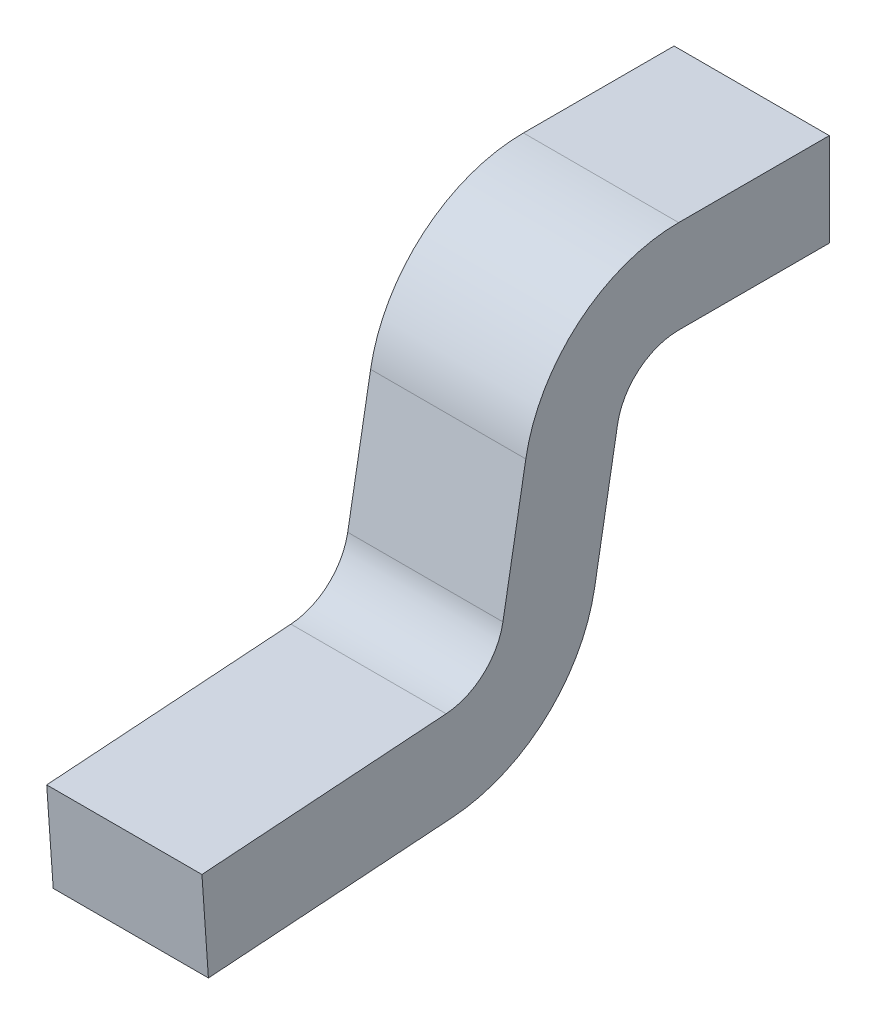
ISO-10303-21;
HEADER;
FILE_DESCRIPTION(('STEP AP214'),'2;1');
FILE_NAME('part.step','',(''),(''),'','','');
FILE_SCHEMA(('AUTOMOTIVE_DESIGN { 1 0 10303 214 1 1 1 1 }'));
ENDSEC;
DATA;
#1=APPLICATION_CONTEXT('core data for automotive mechanical design processes');
#2=APPLICATION_PROTOCOL_DEFINITION('international standard','automotive_design',2000,#1);
#3=PRODUCT_CONTEXT('',#1,'mechanical');
#4=PRODUCT('Part','Part','',(#3));
#5=PRODUCT_RELATED_PRODUCT_CATEGORY('part','',(#4));
#6=PRODUCT_DEFINITION_FORMATION('','',#4);
#7=PRODUCT_DEFINITION_CONTEXT('part definition',#1,'design');
#8=PRODUCT_DEFINITION('design','',#6,#7);
#9=PRODUCT_DEFINITION_SHAPE('','',#8);
#10=(LENGTH_UNIT() NAMED_UNIT(*) SI_UNIT(.MILLI.,.METRE.));
#11=(NAMED_UNIT(*) PLANE_ANGLE_UNIT() SI_UNIT($,.RADIAN.));
#12=(NAMED_UNIT(*) SI_UNIT($,.STERADIAN.) SOLID_ANGLE_UNIT());
#13=UNCERTAINTY_MEASURE_WITH_UNIT(LENGTH_MEASURE(1.E-05),#10,'distance_accuracy_value','');
#14=(GEOMETRIC_REPRESENTATION_CONTEXT(3) GLOBAL_UNCERTAINTY_ASSIGNED_CONTEXT((#13)) GLOBAL_UNIT_ASSIGNED_CONTEXT((#10,
#11,#12)) REPRESENTATION_CONTEXT('',''));
#15=CARTESIAN_POINT('',(0.,0.,0.));
#16=DIRECTION('',(0.,0.,1.));
#17=DIRECTION('',(1.,0.,0.));
#18=AXIS2_PLACEMENT_3D('',#15,#16,#17);
#19=CARTESIAN_POINT('',(-0.125,0.,0.));
#20=DIRECTION('',(1.,0.,0.));
#21=DIRECTION('',(0.,0.,-1.));
#22=AXIS2_PLACEMENT_3D('',#19,#20,#21);
#23=PLANE('',#22);
#24=DIRECTION('',(0.,0.,1.));
#25=VECTOR('',#24,1.);
#26=CARTESIAN_POINT('',(-0.125,0.425,-0.375));
#27=LINE('',#26,#25);
#28=CARTESIAN_POINT('',(-0.125,0.425,-0.375));
#29=VERTEX_POINT('',#28);
#30=CARTESIAN_POINT('',(-0.125,0.425,-0.1323998828126));
#31=VERTEX_POINT('',#30);
#32=EDGE_CURVE('E11',#29,#31,#27,.T.);
#33=ORIENTED_EDGE('',*,*,#32,.F.);
#34=DIRECTION('',(0.,1.,0.));
#35=VECTOR('',#34,1.);
#36=CARTESIAN_POINT('',(-0.125,0.275,-0.375));
#37=LINE('',#36,#35);
#38=CARTESIAN_POINT('',(-0.125,0.275,-0.375));
#39=VERTEX_POINT('',#38);
#40=EDGE_CURVE('E202',#39,#29,#37,.T.);
#41=ORIENTED_EDGE('',*,*,#40,.F.);
#42=DIRECTION('',(0.,0.,-1.));
#43=VECTOR('',#42,1.);
#44=CARTESIAN_POINT('',(-0.125,0.275,-0.1323998828126));
#45=LINE('',#44,#43);
#46=CARTESIAN_POINT('',(-0.125,0.275,-0.1323998828126));
#47=VERTEX_POINT('',#46);
#48=EDGE_CURVE('E194',#47,#39,#45,.T.);
#49=ORIENTED_EDGE('',*,*,#48,.F.);
#50=CARTESIAN_POINT('',(-0.125,0.175,-0.1323998828126));
#51=DIRECTION('',(1.,0.,0.));
#52=DIRECTION('',(0.,1.,0.));
#53=AXIS2_PLACEMENT_3D('',#50,#51,#52);
#54=CIRCLE('',#53,0.1);
#55=CARTESIAN_POINT('',(-0.125,0.1923648177667,-0.03391910751134));
#56=VERTEX_POINT('',#55);
#57=EDGE_CURVE('E187',#47,#56,#54,.T.);
#58=ORIENTED_EDGE('',*,*,#57,.T.);
#59=DIRECTION('',(0.,-0.984807753012213,0.173648177666902));
#60=VECTOR('',#59,1.);
#61=CARTESIAN_POINT('',(-0.125,0.1923648177667,-0.03391910751134));
#62=LINE('',#61,#60);
#63=CARTESIAN_POINT('',(-0.125,-0.01651708444881,0.002912407630965));
#64=VERTEX_POINT('',#63);
#65=EDGE_CURVE('E180',#56,#64,#62,.T.);
#66=ORIENTED_EDGE('',*,*,#65,.T.);
#67=CARTESIAN_POINT('',(-0.125,0.02689495996792,0.249114345884));
#68=DIRECTION('',(-1.,0.,0.));
#69=DIRECTION('',(0.,-0.173648177666902,-0.984807753012213));
#70=AXIS2_PLACEMENT_3D('',#67,#68,#69);
#71=CIRCLE('',#70,0.25);
#72=CARTESIAN_POINT('',(-0.125,-0.222496052597,0.231675227448));
#73=VERTEX_POINT('',#72);
#74=EDGE_CURVE('E175',#64,#73,#71,.T.);
#75=ORIENTED_EDGE('',*,*,#74,.T.);
#76=DIRECTION('',(0.,0.0697564737441317,-0.997564050259824));
#77=VECTOR('',#76,1.);
#78=CARTESIAN_POINT('',(-0.125,-0.25,0.625));
#79=LINE('',#78,#77);
#80=CARTESIAN_POINT('',(-0.125,-0.25,0.625));
#81=VERTEX_POINT('',#80);
#82=EDGE_CURVE('E163',#81,#73,#79,.T.);
#83=ORIENTED_EDGE('',*,*,#82,.F.);
#84=DIRECTION('',(0.,-0.997564050259824,-0.0697564737441316));
#85=VECTOR('',#84,1.);
#86=CARTESIAN_POINT('',(-0.125,-0.100365392461,0.6354634710616));
#87=LINE('',#86,#85);
#88=CARTESIAN_POINT('',(-0.125,-0.100365392461,0.6354634710616));
#89=VERTEX_POINT('',#88);
#90=EDGE_CURVE('E152',#89,#81,#87,.T.);
#91=ORIENTED_EDGE('',*,*,#90,.F.);
#92=DIRECTION('',(0.,-0.0697564737441317,0.997564050259824));
#93=VECTOR('',#92,1.);
#94=CARTESIAN_POINT('',(-0.125,-0.07286144505806,0.2421386985096));
#95=LINE('',#94,#93);
#96=CARTESIAN_POINT('',(-0.125,-0.07286144505806,0.2421386985096));
#97=VERTEX_POINT('',#96);
#98=EDGE_CURVE('E144',#97,#89,#95,.T.);
#99=ORIENTED_EDGE('',*,*,#98,.F.);
#100=CARTESIAN_POINT('',(-0.125,0.02689495996792,0.249114345884));
#101=DIRECTION('',(1.,0.,0.));
#102=DIRECTION('',(0.,-0.997564050259824,-0.0697564737441317));
#103=AXIS2_PLACEMENT_3D('',#100,#101,#102);
#104=CIRCLE('',#103,0.1);
#105=CARTESIAN_POINT('',(-0.125,0.009530142201232,0.1506335705828));
#106=VERTEX_POINT('',#105);
#107=EDGE_CURVE('E128',#97,#106,#104,.T.);
#108=ORIENTED_EDGE('',*,*,#107,.T.);
#109=DIRECTION('',(0.,0.984807753012213,-0.173648177666902));
#110=VECTOR('',#109,1.);
#111=CARTESIAN_POINT('',(-0.125,0.009530142201232,0.1506335705828));
#112=LINE('',#111,#110);
#113=CARTESIAN_POINT('',(-0.125,0.2184120444167,0.1138020554405));
#114=VERTEX_POINT('',#113);
#115=EDGE_CURVE('E125',#106,#114,#112,.T.);
#116=ORIENTED_EDGE('',*,*,#115,.T.);
#117=CARTESIAN_POINT('',(-0.125,0.175,-0.1323998828126));
#118=DIRECTION('',(-1.,0.,0.));
#119=DIRECTION('',(0.,0.173648177666902,0.984807753012213));
#120=AXIS2_PLACEMENT_3D('',#117,#118,#119);
#121=CIRCLE('',#120,0.25);
#122=EDGE_CURVE('E182',#114,#31,#121,.T.);
#123=ORIENTED_EDGE('',*,*,#122,.T.);
#124=EDGE_LOOP('',(#33,#41,#49,#58,#66,#75,#83,#91,#99,#108,#116,#123));
#125=FACE_BOUND('',#124,.T.);
#126=ADVANCED_FACE('F17',(#125),#23,.F.);
#127=CARTESIAN_POINT('',(0.4509,0.175,-0.1323998828126));
#128=DIRECTION('',(-1.,0.,0.));
#129=DIRECTION('',(0.,0.173648177666902,0.984807753012213));
#130=AXIS2_PLACEMENT_3D('',#127,#128,#129);
#131=CYLINDRICAL_SURFACE('',#130,0.25);
#132=DIRECTION('',(-1.,0.,0.));
#133=VECTOR('',#132,1.);
#134=CARTESIAN_POINT('',(0.125,0.2184120444167,0.1138020554405));
#135=LINE('',#134,#133);
#136=CARTESIAN_POINT('',(0.125,0.2184120444167,0.1138020554405));
#137=VERTEX_POINT('',#136);
#138=EDGE_CURVE('E24',#137,#114,#135,.T.);
#139=ORIENTED_EDGE('',*,*,#138,.F.);
#140=CARTESIAN_POINT('',(0.125,0.175,-0.1323998828126));
#141=DIRECTION('',(1.,0.,0.));
#142=DIRECTION('',(0.,1.,0.));
#143=AXIS2_PLACEMENT_3D('',#140,#141,#142);
#144=CIRCLE('',#143,0.25);
#145=CARTESIAN_POINT('',(0.125,0.425,-0.1323998828126));
#146=VERTEX_POINT('',#145);
#147=EDGE_CURVE('E197',#146,#137,#144,.T.);
#148=ORIENTED_EDGE('',*,*,#147,.F.);
#149=DIRECTION('',(-1.,0.,0.));
#150=VECTOR('',#149,1.);
#151=CARTESIAN_POINT('',(0.125,0.425,-0.1323998828126));
#152=LINE('',#151,#150);
#153=EDGE_CURVE('E189',#146,#31,#152,.T.);
#154=ORIENTED_EDGE('',*,*,#153,.T.);
#155=ORIENTED_EDGE('',*,*,#122,.F.);
#156=EDGE_LOOP('',(#139,#148,#154,#155));
#157=FACE_BOUND('',#156,.T.);
#158=ADVANCED_FACE('F208',(#157),#131,.T.);
#159=CARTESIAN_POINT('',(-0.125,0.425,-0.375));
#160=DIRECTION('',(0.,1.,0.));
#161=DIRECTION('',(0.,0.,1.));
#162=AXIS2_PLACEMENT_3D('',#159,#160,#161);
#163=PLANE('',#162);
#164=DIRECTION('',(0.,0.,1.));
#165=VECTOR('',#164,1.);
#166=CARTESIAN_POINT('',(0.125,0.425,-0.375));
#167=LINE('',#166,#165);
#168=CARTESIAN_POINT('',(0.125,0.425,-0.375));
#169=VERTEX_POINT('',#168);
#170=EDGE_CURVE('E199',#169,#146,#167,.T.);
#171=ORIENTED_EDGE('',*,*,#170,.F.);
#172=DIRECTION('',(1.,0.,0.));
#173=VECTOR('',#172,1.);
#174=CARTESIAN_POINT('',(-0.125,0.425,-0.375));
#175=LINE('',#174,#173);
#176=EDGE_CURVE('E191',#29,#169,#175,.T.);
#177=ORIENTED_EDGE('',*,*,#176,.F.);
#178=ORIENTED_EDGE('',*,*,#32,.T.);
#179=ORIENTED_EDGE('',*,*,#153,.F.);
#180=EDGE_LOOP('',(#171,#177,#178,#179));
#181=FACE_BOUND('',#180,.T.);
#182=ADVANCED_FACE('F210',(#181),#163,.T.);
#183=CARTESIAN_POINT('',(-0.125,0.275,-0.375));
#184=DIRECTION('',(0.,0.,-1.));
#185=DIRECTION('',(0.,1.,0.));
#186=AXIS2_PLACEMENT_3D('',#183,#184,#185);
#187=PLANE('',#186);
#188=ORIENTED_EDGE('',*,*,#176,.T.);
#189=DIRECTION('',(0.,1.,0.));
#190=VECTOR('',#189,1.);
#191=CARTESIAN_POINT('',(0.125,0.275,-0.375));
#192=LINE('',#191,#190);
#193=CARTESIAN_POINT('',(0.125,0.275,-0.375));
#194=VERTEX_POINT('',#193);
#195=EDGE_CURVE('E184',#194,#169,#192,.T.);
#196=ORIENTED_EDGE('',*,*,#195,.F.);
#197=DIRECTION('',(1.,0.,0.));
#198=VECTOR('',#197,1.);
#199=CARTESIAN_POINT('',(-0.125,0.275,-0.375));
#200=LINE('',#199,#198);
#201=EDGE_CURVE('E177',#39,#194,#200,.T.);
#202=ORIENTED_EDGE('',*,*,#201,.F.);
#203=ORIENTED_EDGE('',*,*,#40,.T.);
#204=EDGE_LOOP('',(#188,#196,#202,#203));
#205=FACE_BOUND('',#204,.T.);
#206=ADVANCED_FACE('F235',(#205),#187,.T.);
#207=CARTESIAN_POINT('',(-0.125,0.275,-0.04848991969483));
#208=DIRECTION('',(0.,-1.,0.));
#209=DIRECTION('',(0.,0.,-1.));
#210=AXIS2_PLACEMENT_3D('',#207,#208,#209);
#211=PLANE('',#210);
#212=ORIENTED_EDGE('',*,*,#48,.T.);
#213=ORIENTED_EDGE('',*,*,#201,.T.);
#214=DIRECTION('',(0.,0.,-1.));
#215=VECTOR('',#214,1.);
#216=CARTESIAN_POINT('',(0.125,0.275,-0.1323998828126));
#217=LINE('',#216,#215);
#218=CARTESIAN_POINT('',(0.125,0.275,-0.1323998828126));
#219=VERTEX_POINT('',#218);
#220=EDGE_CURVE('E166',#219,#194,#217,.T.);
#221=ORIENTED_EDGE('',*,*,#220,.F.);
#222=DIRECTION('',(-1.,0.,0.));
#223=VECTOR('',#222,1.);
#224=CARTESIAN_POINT('',(0.125,0.275,-0.1323998828126));
#225=LINE('',#224,#223);
#226=EDGE_CURVE('E169',#219,#47,#225,.T.);
#227=ORIENTED_EDGE('',*,*,#226,.T.);
#228=EDGE_LOOP('',(#212,#213,#221,#227));
#229=FACE_BOUND('',#228,.T.);
#230=ADVANCED_FACE('F232',(#229),#211,.T.);
#231=CARTESIAN_POINT('',(0.4509,0.175,-0.1323998828126));
#232=DIRECTION('',(-1.,0.,0.));
#233=DIRECTION('',(0.,0.173648177666902,0.984807753012213));
#234=AXIS2_PLACEMENT_3D('',#231,#232,#233);
#235=CYLINDRICAL_SURFACE('',#234,0.1);
#236=ORIENTED_EDGE('',*,*,#57,.F.);
#237=ORIENTED_EDGE('',*,*,#226,.F.);
#238=CARTESIAN_POINT('',(0.125,0.175,-0.1323998828126));
#239=DIRECTION('',(-1.,0.,0.));
#240=DIRECTION('',(0.,0.173648177666902,0.984807753012213));
#241=AXIS2_PLACEMENT_3D('',#238,#239,#240);
#242=CIRCLE('',#241,0.1);
#243=CARTESIAN_POINT('',(0.125,0.1923648177667,-0.03391910751134));
#244=VERTEX_POINT('',#243);
#245=EDGE_CURVE('E155',#244,#219,#242,.T.);
#246=ORIENTED_EDGE('',*,*,#245,.F.);
#247=DIRECTION('',(-1.,0.,0.));
#248=VECTOR('',#247,1.);
#249=CARTESIAN_POINT('',(0.125,0.1923648177667,-0.03391910751134));
#250=LINE('',#249,#248);
#251=EDGE_CURVE('E146',#244,#56,#250,.T.);
#252=ORIENTED_EDGE('',*,*,#251,.T.);
#253=EDGE_LOOP('',(#236,#237,#246,#252));
#254=FACE_BOUND('',#253,.T.);
#255=ADVANCED_FACE('F230',(#254),#235,.F.);
#256=CARTESIAN_POINT('',(-0.125,-0.208871120024,0.03682961395103));
#257=DIRECTION('',(0.,-0.173648177666902,-0.984807753012213));
#258=DIRECTION('',(0.,0.984807753012213,-0.173648177666902));
#259=AXIS2_PLACEMENT_3D('',#256,#257,#258);
#260=PLANE('',#259);
#261=DIRECTION('',(0.,0.984807753012213,-0.173648177666902));
#262=VECTOR('',#261,1.);
#263=CARTESIAN_POINT('',(0.125,-0.01651708444881,0.002912407630965));
#264=LINE('',#263,#262);
#265=CARTESIAN_POINT('',(0.125,-0.01651708444881,0.002912407630965));
#266=VERTEX_POINT('',#265);
#267=EDGE_CURVE('E172',#266,#244,#264,.T.);
#268=ORIENTED_EDGE('',*,*,#267,.F.);
#269=DIRECTION('',(1.,0.,0.));
#270=VECTOR('',#269,1.);
#271=CARTESIAN_POINT('',(-0.125,-0.01651708444881,0.002912407630965));
#272=LINE('',#271,#270);
#273=EDGE_CURVE('E158',#64,#266,#272,.T.);
#274=ORIENTED_EDGE('',*,*,#273,.F.);
#275=ORIENTED_EDGE('',*,*,#65,.F.);
#276=ORIENTED_EDGE('',*,*,#251,.F.);
#277=EDGE_LOOP('',(#268,#274,#275,#276));
#278=FACE_BOUND('',#277,.T.);
#279=ADVANCED_FACE('F225',(#278),#260,.T.);
#280=CARTESIAN_POINT('',(-0.125,0.02689495996792,0.249114345884));
#281=DIRECTION('',(-1.,0.,0.));
#282=DIRECTION('',(0.,-0.173648177666902,-0.984807753012213));
#283=AXIS2_PLACEMENT_3D('',#280,#281,#282);
#284=CYLINDRICAL_SURFACE('',#283,0.25);
#285=CARTESIAN_POINT('',(0.125,0.02689495996792,0.249114345884));
#286=DIRECTION('',(-1.,0.,0.));
#287=DIRECTION('',(0.,-0.173648177666902,-0.984807753012213));
#288=AXIS2_PLACEMENT_3D('',#285,#286,#287);
#289=CIRCLE('',#288,0.25);
#290=CARTESIAN_POINT('',(0.125,-0.222496052597,0.231675227448));
#291=VERTEX_POINT('',#290);
#292=EDGE_CURVE('E161',#266,#291,#289,.T.);
#293=ORIENTED_EDGE('',*,*,#292,.T.);
#294=DIRECTION('',(1.,0.,0.));
#295=VECTOR('',#294,1.);
#296=CARTESIAN_POINT('',(-0.125,-0.222496052597,0.231675227448));
#297=LINE('',#296,#295);
#298=EDGE_CURVE('E149',#73,#291,#297,.T.);
#299=ORIENTED_EDGE('',*,*,#298,.F.);
#300=ORIENTED_EDGE('',*,*,#74,.F.);
#301=ORIENTED_EDGE('',*,*,#273,.T.);
#302=EDGE_LOOP('',(#293,#299,#300,#301));
#303=FACE_BOUND('',#302,.T.);
#304=ADVANCED_FACE('F221',(#303),#284,.T.);
#305=CARTESIAN_POINT('',(-0.125,-0.25,0.625));
#306=DIRECTION('',(0.,-0.997564050259824,-0.0697564737441317));
#307=DIRECTION('',(0.,0.0697564737441317,-0.997564050259824));
#308=AXIS2_PLACEMENT_3D('',#305,#306,#307);
#309=PLANE('',#308);
#310=ORIENTED_EDGE('',*,*,#298,.T.);
#311=DIRECTION('',(0.,0.0697564737441317,-0.997564050259824));
#312=VECTOR('',#311,1.);
#313=CARTESIAN_POINT('',(0.125,-0.25,0.625));
#314=LINE('',#313,#312);
#315=CARTESIAN_POINT('',(0.125,-0.25,0.625));
#316=VERTEX_POINT('',#315);
#317=EDGE_CURVE('E139',#316,#291,#314,.T.);
#318=ORIENTED_EDGE('',*,*,#317,.F.);
#319=DIRECTION('',(1.,0.,0.));
#320=VECTOR('',#319,1.);
#321=CARTESIAN_POINT('',(-0.125,-0.25,0.625));
#322=LINE('',#321,#320);
#323=EDGE_CURVE('E142',#81,#316,#322,.T.);
#324=ORIENTED_EDGE('',*,*,#323,.F.);
#325=ORIENTED_EDGE('',*,*,#82,.T.);
#326=EDGE_LOOP('',(#310,#318,#324,#325));
#327=FACE_BOUND('',#326,.T.);
#328=ADVANCED_FACE('F217',(#327),#309,.T.);
#329=CARTESIAN_POINT('',(-0.125,-0.100365392461,0.6354634710616));
#330=DIRECTION('',(0.,-0.0697564737441317,0.997564050259824));
#331=DIRECTION('',(0.,-0.997564050259824,-0.0697564737441317));
#332=AXIS2_PLACEMENT_3D('',#329,#330,#331);
#333=PLANE('',#332);
#334=ORIENTED_EDGE('',*,*,#323,.T.);
#335=DIRECTION('',(0.,-0.997564050259824,-0.0697564737441316));
#336=VECTOR('',#335,1.);
#337=CARTESIAN_POINT('',(0.125,-0.100365392461,0.6354634710616));
#338=LINE('',#337,#336);
#339=CARTESIAN_POINT('',(0.125,-0.100365392461,0.6354634710616));
#340=VERTEX_POINT('',#339);
#341=EDGE_CURVE('E135',#340,#316,#338,.T.);
#342=ORIENTED_EDGE('',*,*,#341,.F.);
#343=DIRECTION('',(1.,0.,0.));
#344=VECTOR('',#343,1.);
#345=CARTESIAN_POINT('',(-0.125,-0.100365392461,0.6354634710616));
#346=LINE('',#345,#344);
#347=EDGE_CURVE('E111',#89,#340,#346,.T.);
#348=ORIENTED_EDGE('',*,*,#347,.F.);
#349=ORIENTED_EDGE('',*,*,#90,.T.);
#350=EDGE_LOOP('',(#334,#342,#348,#349));
#351=FACE_BOUND('',#350,.T.);
#352=ADVANCED_FACE('F213',(#351),#333,.T.);
#353=CARTESIAN_POINT('',(-0.125,-0.06741147202885,0.1642004531108));
#354=DIRECTION('',(0.,0.997564050259824,0.0697564737441317));
#355=DIRECTION('',(0.,-0.0697564737441317,0.997564050259824));
#356=AXIS2_PLACEMENT_3D('',#353,#354,#355);
#357=PLANE('',#356);
#358=ORIENTED_EDGE('',*,*,#347,.T.);
#359=DIRECTION('',(0.,-0.0697564737441317,0.997564050259824));
#360=VECTOR('',#359,1.);
#361=CARTESIAN_POINT('',(0.125,-0.07286144505806,0.2421386985096));
#362=LINE('',#361,#360);
#363=CARTESIAN_POINT('',(0.125,-0.07286144505806,0.2421386985096));
#364=VERTEX_POINT('',#363);
#365=EDGE_CURVE('E103',#364,#340,#362,.T.);
#366=ORIENTED_EDGE('',*,*,#365,.F.);
#367=DIRECTION('',(1.,0.,0.));
#368=VECTOR('',#367,1.);
#369=CARTESIAN_POINT('',(-0.125,-0.07286144505806,0.2421386985096));
#370=LINE('',#369,#368);
#371=EDGE_CURVE('E108',#97,#364,#370,.T.);
#372=ORIENTED_EDGE('',*,*,#371,.F.);
#373=ORIENTED_EDGE('',*,*,#98,.T.);
#374=EDGE_LOOP('',(#358,#366,#372,#373));
#375=FACE_BOUND('',#374,.T.);
#376=ADVANCED_FACE('F105',(#375),#357,.T.);
#377=CARTESIAN_POINT('',(-0.125,0.02689495996792,0.249114345884));
#378=DIRECTION('',(1.,0.,0.));
#379=DIRECTION('',(0.,-0.997564050259824,-0.0697564737441317));
#380=AXIS2_PLACEMENT_3D('',#377,#378,#379);
#381=CYLINDRICAL_SURFACE('',#380,0.1);
#382=CARTESIAN_POINT('',(0.125,0.02689495996792,0.249114345884));
#383=DIRECTION('',(1.,0.,0.));
#384=DIRECTION('',(0.,-0.997564050259824,-0.0697564737441317));
#385=AXIS2_PLACEMENT_3D('',#382,#383,#384);
#386=CIRCLE('',#385,0.1);
#387=CARTESIAN_POINT('',(0.125,0.009530142201232,0.1506335705828));
#388=VERTEX_POINT('',#387);
#389=EDGE_CURVE('E115',#364,#388,#386,.T.);
#390=ORIENTED_EDGE('',*,*,#389,.T.);
#391=DIRECTION('',(1.,0.,0.));
#392=VECTOR('',#391,1.);
#393=CARTESIAN_POINT('',(-0.125,0.009530142201232,0.1506335705828));
#394=LINE('',#393,#392);
#395=EDGE_CURVE('E116',#106,#388,#394,.T.);
#396=ORIENTED_EDGE('',*,*,#395,.F.);
#397=ORIENTED_EDGE('',*,*,#107,.F.);
#398=ORIENTED_EDGE('',*,*,#371,.T.);
#399=EDGE_LOOP('',(#390,#396,#397,#398));
#400=FACE_BOUND('',#399,.T.);
#401=ADVANCED_FACE('F127',(#400),#381,.F.);
#402=CARTESIAN_POINT('',(-0.125,0.02604722665004,0.1477211629518));
#403=DIRECTION('',(0.,0.173648177666902,0.984807753012213));
#404=DIRECTION('',(0.,-0.984807753012213,0.173648177666902));
#405=AXIS2_PLACEMENT_3D('',#402,#403,#404);
#406=PLANE('',#405);
#407=ORIENTED_EDGE('',*,*,#115,.F.);
#408=ORIENTED_EDGE('',*,*,#395,.T.);
#409=DIRECTION('',(0.,-0.984807753012213,0.173648177666902));
#410=VECTOR('',#409,1.);
#411=CARTESIAN_POINT('',(0.125,0.2184120444167,0.1138020554405));
#412=LINE('',#411,#410);
#413=EDGE_CURVE('E121',#137,#388,#412,.T.);
#414=ORIENTED_EDGE('',*,*,#413,.F.);
#415=ORIENTED_EDGE('',*,*,#138,.T.);
#416=EDGE_LOOP('',(#407,#408,#414,#415));
#417=FACE_BOUND('',#416,.T.);
#418=ADVANCED_FACE('F206',(#417),#406,.T.);
#419=CARTESIAN_POINT('',(0.125,0.,0.));
#420=DIRECTION('',(1.,0.,0.));
#421=DIRECTION('',(0.,0.,-1.));
#422=AXIS2_PLACEMENT_3D('',#419,#420,#421);
#423=PLANE('',#422);
#424=ORIENTED_EDGE('',*,*,#413,.T.);
#425=ORIENTED_EDGE('',*,*,#389,.F.);
#426=ORIENTED_EDGE('',*,*,#365,.T.);
#427=ORIENTED_EDGE('',*,*,#341,.T.);
#428=ORIENTED_EDGE('',*,*,#317,.T.);
#429=ORIENTED_EDGE('',*,*,#292,.F.);
#430=ORIENTED_EDGE('',*,*,#267,.T.);
#431=ORIENTED_EDGE('',*,*,#245,.T.);
#432=ORIENTED_EDGE('',*,*,#220,.T.);
#433=ORIENTED_EDGE('',*,*,#195,.T.);
#434=ORIENTED_EDGE('',*,*,#170,.T.);
#435=ORIENTED_EDGE('',*,*,#147,.T.);
#436=EDGE_LOOP('',(#424,#425,#426,#427,#428,#429,#430,#431,#432,#433,#434,#435));
#437=FACE_BOUND('',#436,.T.);
#438=ADVANCED_FACE('F119',(#437),#423,.T.);
#439=CLOSED_SHELL('',(#126,#158,#182,#206,#230,#255,#279,#304,#328,#352,#376,#401,#418,#438));
#440=MANIFOLD_SOLID_BREP('B1',#439);
#441=ADVANCED_BREP_SHAPE_REPRESENTATION('',(#18,#440),#14);
#442=SHAPE_DEFINITION_REPRESENTATION(#9,#441);
ENDSEC;
END-ISO-10303-21;
